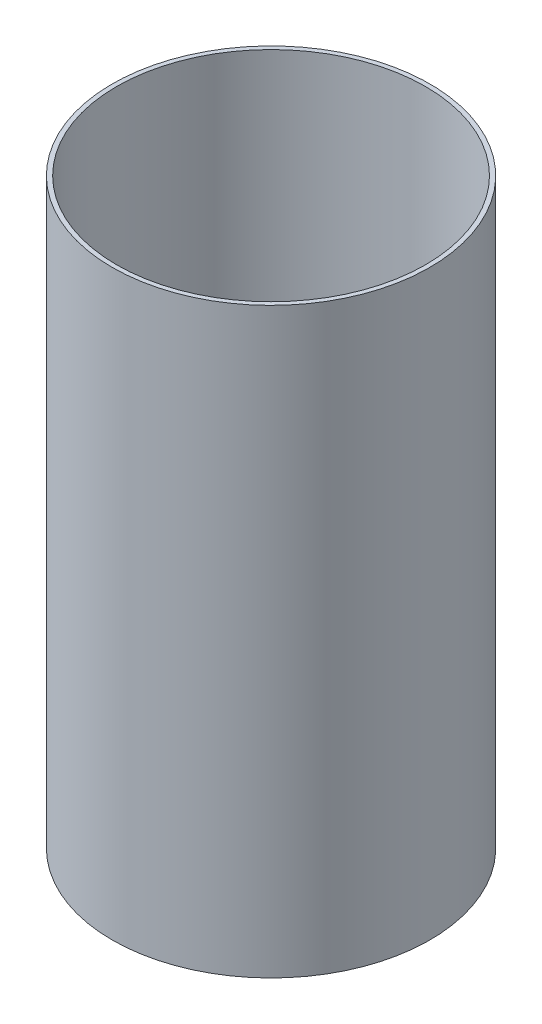
ISO-10303-21;
HEADER;
FILE_DESCRIPTION(('STEP AP214'),'2;1');
FILE_NAME('part.step','',(''),(''),'','','');
FILE_SCHEMA(('AUTOMOTIVE_DESIGN { 1 0 10303 214 1 1 1 1 }'));
ENDSEC;
DATA;
#1=APPLICATION_CONTEXT('core data for automotive mechanical design processes');
#2=APPLICATION_PROTOCOL_DEFINITION('international standard','automotive_design',2000,#1);
#3=PRODUCT_CONTEXT('',#1,'mechanical');
#4=PRODUCT('Part','Part','',(#3));
#5=PRODUCT_RELATED_PRODUCT_CATEGORY('part','',(#4));
#6=PRODUCT_DEFINITION_FORMATION('','',#4);
#7=PRODUCT_DEFINITION_CONTEXT('part definition',#1,'design');
#8=PRODUCT_DEFINITION('design','',#6,#7);
#9=PRODUCT_DEFINITION_SHAPE('','',#8);
#10=(LENGTH_UNIT() NAMED_UNIT(*) SI_UNIT(.MILLI.,.METRE.));
#11=(NAMED_UNIT(*) PLANE_ANGLE_UNIT() SI_UNIT($,.RADIAN.));
#12=(NAMED_UNIT(*) SI_UNIT($,.STERADIAN.) SOLID_ANGLE_UNIT());
#13=UNCERTAINTY_MEASURE_WITH_UNIT(LENGTH_MEASURE(1.E-05),#10,'distance_accuracy_value','');
#14=(GEOMETRIC_REPRESENTATION_CONTEXT(3) GLOBAL_UNCERTAINTY_ASSIGNED_CONTEXT((#13)) GLOBAL_UNIT_ASSIGNED_CONTEXT((#10,
#11,#12)) REPRESENTATION_CONTEXT('',''));
#15=CARTESIAN_POINT('',(0.,0.,0.));
#16=DIRECTION('',(0.,0.,1.));
#17=DIRECTION('',(1.,0.,0.));
#18=AXIS2_PLACEMENT_3D('',#15,#16,#17);
#19=CARTESIAN_POINT('',(0.,209.55,0.));
#20=DIRECTION('',(0.,-1.,0.));
#21=DIRECTION('',(0.,0.,-1.));
#22=AXIS2_PLACEMENT_3D('',#19,#20,#21);
#23=CYLINDRICAL_SURFACE('',#22,57.15);
#24=CARTESIAN_POINT('',(0.,209.55,0.));
#25=DIRECTION('',(0.,1.,0.));
#26=DIRECTION('',(0.,0.,1.));
#27=AXIS2_PLACEMENT_3D('',#24,#25,#26);
#28=CIRCLE('',#27,57.15);
#29=CARTESIAN_POINT('',(0.,209.55,57.15));
#30=VERTEX_POINT('',#29);
#31=EDGE_CURVE('E10',#30,#30,#28,.T.);
#32=ORIENTED_EDGE('',*,*,#31,.F.);
#33=EDGE_LOOP('',(#32));
#34=FACE_BOUND('',#33,.T.);
#35=CARTESIAN_POINT('',(0.,0.,0.));
#36=DIRECTION('',(0.,1.,0.));
#37=DIRECTION('',(0.,0.,1.));
#38=AXIS2_PLACEMENT_3D('',#35,#36,#37);
#39=CIRCLE('',#38,57.15);
#40=CARTESIAN_POINT('',(0.,0.,57.15));
#41=VERTEX_POINT('',#40);
#42=EDGE_CURVE('E34',#41,#41,#39,.T.);
#43=ORIENTED_EDGE('',*,*,#42,.T.);
#44=EDGE_LOOP('',(#43));
#45=FACE_BOUND('',#44,.T.);
#46=ADVANCED_FACE('F31',(#34,#45),#23,.T.);
#47=CARTESIAN_POINT('',(0.,209.55,0.));
#48=DIRECTION('',(0.,1.,0.));
#49=DIRECTION('',(0.,0.,1.));
#50=AXIS2_PLACEMENT_3D('',#47,#48,#49);
#51=PLANE('',#50);
#52=CARTESIAN_POINT('',(0.,209.55,0.));
#53=DIRECTION('',(0.,-1.,0.));
#54=DIRECTION('',(0.,0.,-1.));
#55=AXIS2_PLACEMENT_3D('',#52,#53,#54);
#56=CIRCLE('',#55,55.5625);
#57=CARTESIAN_POINT('',(0.,209.55,-55.5625));
#58=VERTEX_POINT('',#57);
#59=EDGE_CURVE('E41',#58,#58,#56,.T.);
#60=ORIENTED_EDGE('',*,*,#59,.T.);
#61=EDGE_LOOP('',(#60));
#62=FACE_BOUND('',#61,.T.);
#63=ORIENTED_EDGE('',*,*,#31,.T.);
#64=EDGE_LOOP('',(#63));
#65=FACE_BOUND('',#64,.T.);
#66=ADVANCED_FACE('F49',(#62,#65),#51,.T.);
#67=CARTESIAN_POINT('',(0.,0.,0.));
#68=DIRECTION('',(0.,1.,0.));
#69=DIRECTION('',(0.,0.,1.));
#70=AXIS2_PLACEMENT_3D('',#67,#68,#69);
#71=PLANE('',#70);
#72=CARTESIAN_POINT('',(0.,0.,0.));
#73=DIRECTION('',(0.,-1.,0.));
#74=DIRECTION('',(0.,0.,-1.));
#75=AXIS2_PLACEMENT_3D('',#72,#73,#74);
#76=CIRCLE('',#75,55.5625);
#77=CARTESIAN_POINT('',(0.,0.,-55.5625));
#78=VERTEX_POINT('',#77);
#79=EDGE_CURVE('E43',#78,#78,#76,.T.);
#80=ORIENTED_EDGE('',*,*,#79,.F.);
#81=EDGE_LOOP('',(#80));
#82=FACE_BOUND('',#81,.T.);
#83=ORIENTED_EDGE('',*,*,#42,.F.);
#84=EDGE_LOOP('',(#83));
#85=FACE_BOUND('',#84,.T.);
#86=ADVANCED_FACE('F54',(#82,#85),#71,.F.);
#87=CARTESIAN_POINT('',(0.,209.55,0.));
#88=DIRECTION('',(0.,-1.,0.));
#89=DIRECTION('',(0.,0.,-1.));
#90=AXIS2_PLACEMENT_3D('',#87,#88,#89);
#91=CYLINDRICAL_SURFACE('',#90,55.5625);
#92=ORIENTED_EDGE('',*,*,#59,.F.);
#93=EDGE_LOOP('',(#92));
#94=FACE_BOUND('',#93,.T.);
#95=ORIENTED_EDGE('',*,*,#79,.T.);
#96=EDGE_LOOP('',(#95));
#97=FACE_BOUND('',#96,.T.);
#98=ADVANCED_FACE('F51',(#94,#97),#91,.F.);
#99=CLOSED_SHELL('',(#46,#66,#86,#98));
#100=MANIFOLD_SOLID_BREP('B2',#99);
#101=ADVANCED_BREP_SHAPE_REPRESENTATION('',(#18,#100),#14);
#102=SHAPE_DEFINITION_REPRESENTATION(#9,#101);
ENDSEC;
END-ISO-10303-21;
